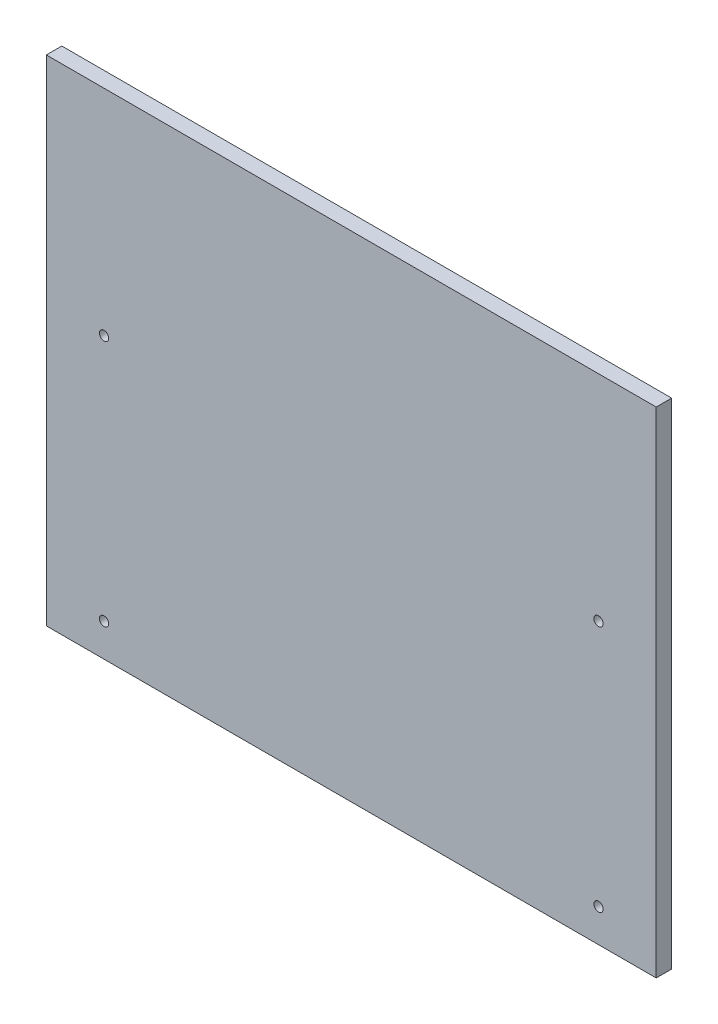
ISO-10303-21;
HEADER;
FILE_DESCRIPTION(('STEP AP214'),'2;1');
FILE_NAME('part.step','',(''),(''),'','','');
FILE_SCHEMA(('AUTOMOTIVE_DESIGN { 1 0 10303 214 1 1 1 1 }'));
ENDSEC;
DATA;
#1=APPLICATION_CONTEXT('core data for automotive mechanical design processes');
#2=APPLICATION_PROTOCOL_DEFINITION('international standard','automotive_design',2000,#1);
#3=PRODUCT_CONTEXT('',#1,'mechanical');
#4=PRODUCT('Part','Part','',(#3));
#5=PRODUCT_RELATED_PRODUCT_CATEGORY('part','',(#4));
#6=PRODUCT_DEFINITION_FORMATION('','',#4);
#7=PRODUCT_DEFINITION_CONTEXT('part definition',#1,'design');
#8=PRODUCT_DEFINITION('design','',#6,#7);
#9=PRODUCT_DEFINITION_SHAPE('','',#8);
#10=(LENGTH_UNIT() NAMED_UNIT(*) SI_UNIT(.MILLI.,.METRE.));
#11=(NAMED_UNIT(*) PLANE_ANGLE_UNIT() SI_UNIT($,.RADIAN.));
#12=(NAMED_UNIT(*) SI_UNIT($,.STERADIAN.) SOLID_ANGLE_UNIT());
#13=UNCERTAINTY_MEASURE_WITH_UNIT(LENGTH_MEASURE(1.E-05),#10,'distance_accuracy_value','');
#14=(GEOMETRIC_REPRESENTATION_CONTEXT(3) GLOBAL_UNCERTAINTY_ASSIGNED_CONTEXT((#13)) GLOBAL_UNIT_ASSIGNED_CONTEXT((#10,
#11,#12)) REPRESENTATION_CONTEXT('',''));
#15=CARTESIAN_POINT('',(0.,0.,0.));
#16=DIRECTION('',(0.,0.,1.));
#17=DIRECTION('',(1.,0.,0.));
#18=AXIS2_PLACEMENT_3D('',#15,#16,#17);
#19=CARTESIAN_POINT('',(234.95,-190.5,11.90625));
#20=DIRECTION('',(-1.,0.,0.));
#21=DIRECTION('',(0.,0.,1.));
#22=AXIS2_PLACEMENT_3D('',#19,#20,#21);
#23=PLANE('',#22);
#24=DIRECTION('',(0.,1.,0.));
#25=VECTOR('',#24,1.);
#26=CARTESIAN_POINT('',(234.95,-190.5,0.));
#27=LINE('',#26,#25);
#28=CARTESIAN_POINT('',(234.95,-190.5,0.));
#29=VERTEX_POINT('',#28);
#30=CARTESIAN_POINT('',(234.95,190.5,0.));
#31=VERTEX_POINT('',#30);
#32=EDGE_CURVE('E98',#29,#31,#27,.T.);
#33=ORIENTED_EDGE('',*,*,#32,.T.);
#34=DIRECTION('',(0.,0.,-1.));
#35=VECTOR('',#34,1.);
#36=CARTESIAN_POINT('',(234.95,190.5,11.90625));
#37=LINE('',#36,#35);
#38=CARTESIAN_POINT('',(234.95,190.5,11.90625));
#39=VERTEX_POINT('',#38);
#40=EDGE_CURVE('E11',#39,#31,#37,.T.);
#41=ORIENTED_EDGE('',*,*,#40,.F.);
#42=DIRECTION('',(0.,1.,0.));
#43=VECTOR('',#42,1.);
#44=CARTESIAN_POINT('',(234.95,-190.5,11.90625));
#45=LINE('',#44,#43);
#46=CARTESIAN_POINT('',(234.95,-190.5,11.90625));
#47=VERTEX_POINT('',#46);
#48=EDGE_CURVE('E86',#47,#39,#45,.T.);
#49=ORIENTED_EDGE('',*,*,#48,.F.);
#50=DIRECTION('',(0.,0.,-1.));
#51=VECTOR('',#50,1.);
#52=CARTESIAN_POINT('',(234.95,-190.5,11.90625));
#53=LINE('',#52,#51);
#54=EDGE_CURVE('E94',#47,#29,#53,.T.);
#55=ORIENTED_EDGE('',*,*,#54,.T.);
#56=EDGE_LOOP('',(#33,#41,#49,#55));
#57=FACE_BOUND('',#56,.T.);
#58=ADVANCED_FACE('F35',(#57),#23,.F.);
#59=CARTESIAN_POINT('',(-234.95,190.5,11.90625));
#60=DIRECTION('',(0.,-1.,0.));
#61=DIRECTION('',(0.,0.,-1.));
#62=AXIS2_PLACEMENT_3D('',#59,#60,#61);
#63=PLANE('',#62);
#64=DIRECTION('',(-1.,0.,0.));
#65=VECTOR('',#64,1.);
#66=CARTESIAN_POINT('',(-234.95,190.5,0.));
#67=LINE('',#66,#65);
#68=CARTESIAN_POINT('',(-234.95,190.5,0.));
#69=VERTEX_POINT('',#68);
#70=EDGE_CURVE('E90',#31,#69,#67,.T.);
#71=ORIENTED_EDGE('',*,*,#70,.T.);
#72=DIRECTION('',(0.,0.,-1.));
#73=VECTOR('',#72,1.);
#74=CARTESIAN_POINT('',(-234.95,190.5,11.90625));
#75=LINE('',#74,#73);
#76=CARTESIAN_POINT('',(-234.95,190.5,11.90625));
#77=VERTEX_POINT('',#76);
#78=EDGE_CURVE('E43',#77,#69,#75,.T.);
#79=ORIENTED_EDGE('',*,*,#78,.F.);
#80=DIRECTION('',(-1.,0.,0.));
#81=VECTOR('',#80,1.);
#82=CARTESIAN_POINT('',(-234.95,190.5,11.90625));
#83=LINE('',#82,#81);
#84=EDGE_CURVE('E81',#39,#77,#83,.T.);
#85=ORIENTED_EDGE('',*,*,#84,.F.);
#86=ORIENTED_EDGE('',*,*,#40,.T.);
#87=EDGE_LOOP('',(#71,#79,#85,#86));
#88=FACE_BOUND('',#87,.T.);
#89=ADVANCED_FACE('F89',(#88),#63,.F.);
#90=CARTESIAN_POINT('',(-234.95,-190.5,11.90625));
#91=DIRECTION('',(1.,0.,0.));
#92=DIRECTION('',(0.,0.,-1.));
#93=AXIS2_PLACEMENT_3D('',#90,#91,#92);
#94=PLANE('',#93);
#95=DIRECTION('',(0.,-1.,0.));
#96=VECTOR('',#95,1.);
#97=CARTESIAN_POINT('',(-234.95,-190.5,0.));
#98=LINE('',#97,#96);
#99=CARTESIAN_POINT('',(-234.95,-190.5,0.));
#100=VERTEX_POINT('',#99);
#101=EDGE_CURVE('E68',#69,#100,#98,.T.);
#102=ORIENTED_EDGE('',*,*,#101,.T.);
#103=DIRECTION('',(0.,0.,-1.));
#104=VECTOR('',#103,1.);
#105=CARTESIAN_POINT('',(-234.95,-190.5,11.90625));
#106=LINE('',#105,#104);
#107=CARTESIAN_POINT('',(-234.95,-190.5,11.90625));
#108=VERTEX_POINT('',#107);
#109=EDGE_CURVE('E91',#108,#100,#106,.T.);
#110=ORIENTED_EDGE('',*,*,#109,.F.);
#111=DIRECTION('',(0.,-1.,0.));
#112=VECTOR('',#111,1.);
#113=CARTESIAN_POINT('',(-234.95,-190.5,11.90625));
#114=LINE('',#113,#112);
#115=EDGE_CURVE('E84',#77,#108,#114,.T.);
#116=ORIENTED_EDGE('',*,*,#115,.F.);
#117=ORIENTED_EDGE('',*,*,#78,.T.);
#118=EDGE_LOOP('',(#102,#110,#116,#117));
#119=FACE_BOUND('',#118,.T.);
#120=ADVANCED_FACE('F92',(#119),#94,.F.);
#121=CARTESIAN_POINT('',(-234.95,-190.5,11.90625));
#122=DIRECTION('',(0.,1.,0.));
#123=DIRECTION('',(0.,0.,1.));
#124=AXIS2_PLACEMENT_3D('',#121,#122,#123);
#125=PLANE('',#124);
#126=DIRECTION('',(1.,0.,0.));
#127=VECTOR('',#126,1.);
#128=CARTESIAN_POINT('',(-234.95,-190.5,0.));
#129=LINE('',#128,#127);
#130=EDGE_CURVE('E74',#100,#29,#129,.T.);
#131=ORIENTED_EDGE('',*,*,#130,.T.);
#132=ORIENTED_EDGE('',*,*,#54,.F.);
#133=DIRECTION('',(1.,0.,0.));
#134=VECTOR('',#133,1.);
#135=CARTESIAN_POINT('',(-234.95,-190.5,11.90625));
#136=LINE('',#135,#134);
#137=EDGE_CURVE('E51',#108,#47,#136,.T.);
#138=ORIENTED_EDGE('',*,*,#137,.F.);
#139=ORIENTED_EDGE('',*,*,#109,.T.);
#140=EDGE_LOOP('',(#131,#132,#138,#139));
#141=FACE_BOUND('',#140,.T.);
#142=ADVANCED_FACE('F106',(#141),#125,.F.);
#143=CARTESIAN_POINT('',(0.,0.,11.90625));
#144=DIRECTION('',(0.,0.,-1.));
#145=DIRECTION('',(-1.,0.,0.));
#146=AXIS2_PLACEMENT_3D('',#143,#144,#145);
#147=PLANE('',#146);
#148=CARTESIAN_POINT('',(-190.5,25.4,11.90625));
#149=DIRECTION('',(0.,0.,1.));
#150=DIRECTION('',(1.,0.,0.));
#151=AXIS2_PLACEMENT_3D('',#148,#149,#150);
#152=CIRCLE('',#151,3.571875);
#153=CARTESIAN_POINT('',(-186.928125,25.4,11.90625));
#154=VERTEX_POINT('',#153);
#155=EDGE_CURVE('E132',#154,#154,#152,.T.);
#156=ORIENTED_EDGE('',*,*,#155,.F.);
#157=EDGE_LOOP('',(#156));
#158=FACE_BOUND('',#157,.T.);
#159=CARTESIAN_POINT('',(190.5,25.4,11.90625));
#160=DIRECTION('',(0.,0.,1.));
#161=DIRECTION('',(1.,0.,0.));
#162=AXIS2_PLACEMENT_3D('',#159,#160,#161);
#163=CIRCLE('',#162,3.571875);
#164=CARTESIAN_POINT('',(194.071875,25.4,11.90625));
#165=VERTEX_POINT('',#164);
#166=EDGE_CURVE('E126',#165,#165,#163,.T.);
#167=ORIENTED_EDGE('',*,*,#166,.F.);
#168=EDGE_LOOP('',(#167));
#169=FACE_BOUND('',#168,.T.);
#170=CARTESIAN_POINT('',(190.5,-165.1,11.90625));
#171=DIRECTION('',(0.,0.,1.));
#172=DIRECTION('',(1.,0.,0.));
#173=AXIS2_PLACEMENT_3D('',#170,#171,#172);
#174=CIRCLE('',#173,3.571875);
#175=CARTESIAN_POINT('',(194.071875,-165.1,11.90625));
#176=VERTEX_POINT('',#175);
#177=EDGE_CURVE('E120',#176,#176,#174,.T.);
#178=ORIENTED_EDGE('',*,*,#177,.F.);
#179=EDGE_LOOP('',(#178));
#180=FACE_BOUND('',#179,.T.);
#181=CARTESIAN_POINT('',(-190.5,-165.1,11.90625));
#182=DIRECTION('',(0.,0.,1.));
#183=DIRECTION('',(1.,0.,0.));
#184=AXIS2_PLACEMENT_3D('',#181,#182,#183);
#185=CIRCLE('',#184,3.571875);
#186=CARTESIAN_POINT('',(-186.928125,-165.1,11.90625));
#187=VERTEX_POINT('',#186);
#188=EDGE_CURVE('E114',#187,#187,#185,.T.);
#189=ORIENTED_EDGE('',*,*,#188,.F.);
#190=EDGE_LOOP('',(#189));
#191=FACE_BOUND('',#190,.T.);
#192=ORIENTED_EDGE('',*,*,#48,.T.);
#193=ORIENTED_EDGE('',*,*,#84,.T.);
#194=ORIENTED_EDGE('',*,*,#115,.T.);
#195=ORIENTED_EDGE('',*,*,#137,.T.);
#196=EDGE_LOOP('',(#192,#193,#194,#195));
#197=FACE_BOUND('',#196,.T.);
#198=ADVANCED_FACE('F82',(#158,#169,#180,#191,#197),#147,.F.);
#199=CARTESIAN_POINT('',(0.,0.,0.));
#200=DIRECTION('',(0.,0.,-1.));
#201=DIRECTION('',(-1.,0.,0.));
#202=AXIS2_PLACEMENT_3D('',#199,#200,#201);
#203=PLANE('',#202);
#204=CARTESIAN_POINT('',(-190.5,25.4,0.));
#205=DIRECTION('',(0.,0.,1.));
#206=DIRECTION('',(1.,0.,0.));
#207=AXIS2_PLACEMENT_3D('',#204,#205,#206);
#208=CIRCLE('',#207,3.571875);
#209=CARTESIAN_POINT('',(-186.928125,25.4,0.));
#210=VERTEX_POINT('',#209);
#211=EDGE_CURVE('E129',#210,#210,#208,.T.);
#212=ORIENTED_EDGE('',*,*,#211,.T.);
#213=EDGE_LOOP('',(#212));
#214=FACE_BOUND('',#213,.T.);
#215=CARTESIAN_POINT('',(190.5,25.4,0.));
#216=DIRECTION('',(0.,0.,1.));
#217=DIRECTION('',(1.,0.,0.));
#218=AXIS2_PLACEMENT_3D('',#215,#216,#217);
#219=CIRCLE('',#218,3.571875);
#220=CARTESIAN_POINT('',(194.071875,25.4,0.));
#221=VERTEX_POINT('',#220);
#222=EDGE_CURVE('E123',#221,#221,#219,.T.);
#223=ORIENTED_EDGE('',*,*,#222,.T.);
#224=EDGE_LOOP('',(#223));
#225=FACE_BOUND('',#224,.T.);
#226=CARTESIAN_POINT('',(190.5,-165.1,0.));
#227=DIRECTION('',(0.,0.,1.));
#228=DIRECTION('',(1.,0.,0.));
#229=AXIS2_PLACEMENT_3D('',#226,#227,#228);
#230=CIRCLE('',#229,3.571875);
#231=CARTESIAN_POINT('',(194.071875,-165.1,0.));
#232=VERTEX_POINT('',#231);
#233=EDGE_CURVE('E117',#232,#232,#230,.T.);
#234=ORIENTED_EDGE('',*,*,#233,.T.);
#235=EDGE_LOOP('',(#234));
#236=FACE_BOUND('',#235,.T.);
#237=CARTESIAN_POINT('',(-190.5,-165.1,0.));
#238=DIRECTION('',(0.,0.,1.));
#239=DIRECTION('',(1.,0.,0.));
#240=AXIS2_PLACEMENT_3D('',#237,#238,#239);
#241=CIRCLE('',#240,3.571875);
#242=CARTESIAN_POINT('',(-186.928125,-165.1,0.));
#243=VERTEX_POINT('',#242);
#244=EDGE_CURVE('E101',#243,#243,#241,.T.);
#245=ORIENTED_EDGE('',*,*,#244,.T.);
#246=EDGE_LOOP('',(#245));
#247=FACE_BOUND('',#246,.T.);
#248=ORIENTED_EDGE('',*,*,#32,.F.);
#249=ORIENTED_EDGE('',*,*,#130,.F.);
#250=ORIENTED_EDGE('',*,*,#101,.F.);
#251=ORIENTED_EDGE('',*,*,#70,.F.);
#252=EDGE_LOOP('',(#248,#249,#250,#251));
#253=FACE_BOUND('',#252,.T.);
#254=ADVANCED_FACE('F109',(#214,#225,#236,#247,#253),#203,.T.);
#255=CARTESIAN_POINT('',(-190.5,-165.1,11.90625));
#256=DIRECTION('',(0.,0.,1.));
#257=DIRECTION('',(1.,0.,0.));
#258=AXIS2_PLACEMENT_3D('',#255,#256,#257);
#259=CYLINDRICAL_SURFACE('',#258,3.571875);
#260=ORIENTED_EDGE('',*,*,#244,.F.);
#261=EDGE_LOOP('',(#260));
#262=FACE_BOUND('',#261,.T.);
#263=ORIENTED_EDGE('',*,*,#188,.T.);
#264=EDGE_LOOP('',(#263));
#265=FACE_BOUND('',#264,.T.);
#266=ADVANCED_FACE('F147',(#262,#265),#259,.F.);
#267=CARTESIAN_POINT('',(190.5,-165.1,11.90625));
#268=DIRECTION('',(0.,0.,1.));
#269=DIRECTION('',(1.,0.,0.));
#270=AXIS2_PLACEMENT_3D('',#267,#268,#269);
#271=CYLINDRICAL_SURFACE('',#270,3.571875);
#272=ORIENTED_EDGE('',*,*,#233,.F.);
#273=EDGE_LOOP('',(#272));
#274=FACE_BOUND('',#273,.T.);
#275=ORIENTED_EDGE('',*,*,#177,.T.);
#276=EDGE_LOOP('',(#275));
#277=FACE_BOUND('',#276,.T.);
#278=ADVANCED_FACE('F149',(#274,#277),#271,.F.);
#279=CARTESIAN_POINT('',(190.5,25.4,11.90625));
#280=DIRECTION('',(0.,0.,1.));
#281=DIRECTION('',(1.,0.,0.));
#282=AXIS2_PLACEMENT_3D('',#279,#280,#281);
#283=CYLINDRICAL_SURFACE('',#282,3.571875);
#284=ORIENTED_EDGE('',*,*,#222,.F.);
#285=EDGE_LOOP('',(#284));
#286=FACE_BOUND('',#285,.T.);
#287=ORIENTED_EDGE('',*,*,#166,.T.);
#288=EDGE_LOOP('',(#287));
#289=FACE_BOUND('',#288,.T.);
#290=ADVANCED_FACE('F156',(#286,#289),#283,.F.);
#291=CARTESIAN_POINT('',(-190.5,25.4,11.90625));
#292=DIRECTION('',(0.,0.,1.));
#293=DIRECTION('',(1.,0.,0.));
#294=AXIS2_PLACEMENT_3D('',#291,#292,#293);
#295=CYLINDRICAL_SURFACE('',#294,3.571875);
#296=ORIENTED_EDGE('',*,*,#211,.F.);
#297=EDGE_LOOP('',(#296));
#298=FACE_BOUND('',#297,.T.);
#299=ORIENTED_EDGE('',*,*,#155,.T.);
#300=EDGE_LOOP('',(#299));
#301=FACE_BOUND('',#300,.T.);
#302=ADVANCED_FACE('F136',(#298,#301),#295,.F.);
#303=CLOSED_SHELL('',(#58,#89,#120,#142,#198,#254,#266,#278,#290,#302));
#304=MANIFOLD_SOLID_BREP('B2',#303);
#305=ADVANCED_BREP_SHAPE_REPRESENTATION('',(#18,#304),#14);
#306=SHAPE_DEFINITION_REPRESENTATION(#9,#305);
ENDSEC;
END-ISO-10303-21;
